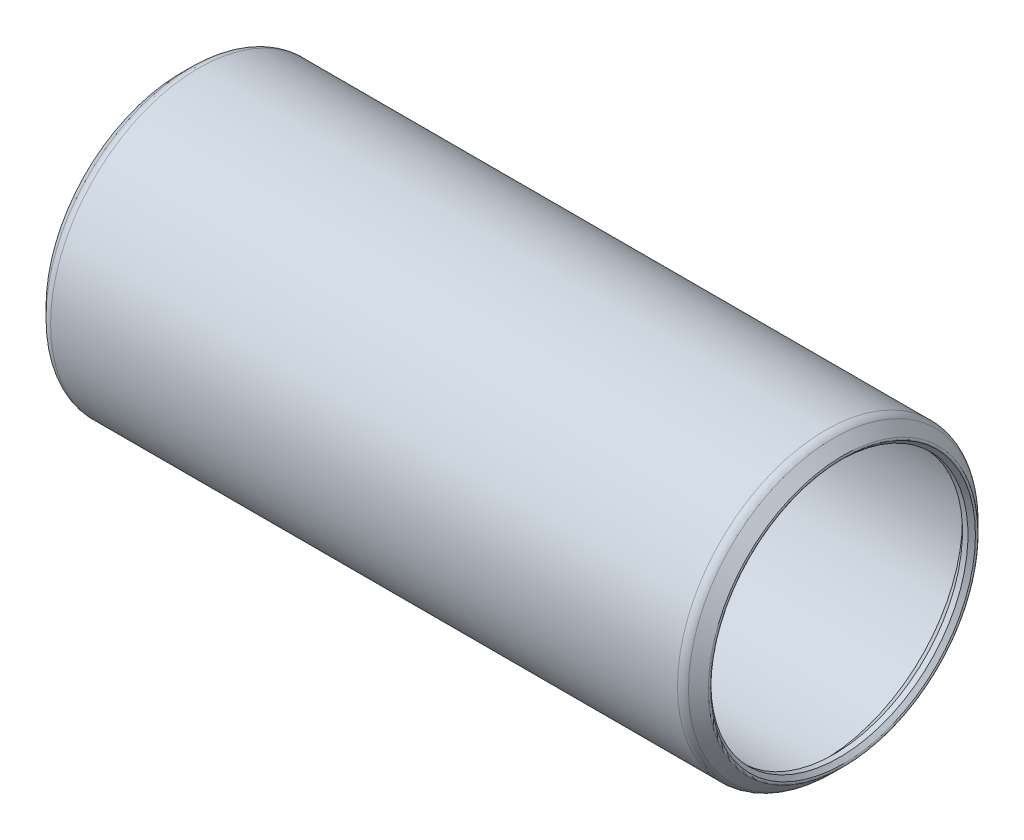
ISO-10303-21;
HEADER;
FILE_DESCRIPTION(('STEP AP214'),'2;1');
FILE_NAME('part.step','',(''),(''),'','','');
FILE_SCHEMA(('AUTOMOTIVE_DESIGN { 1 0 10303 214 1 1 1 1 }'));
ENDSEC;
DATA;
#1=APPLICATION_CONTEXT('core data for automotive mechanical design processes');
#2=APPLICATION_PROTOCOL_DEFINITION('international standard','automotive_design',2000,#1);
#3=PRODUCT_CONTEXT('',#1,'mechanical');
#4=PRODUCT('Part','Part','',(#3));
#5=PRODUCT_RELATED_PRODUCT_CATEGORY('part','',(#4));
#6=PRODUCT_DEFINITION_FORMATION('','',#4);
#7=PRODUCT_DEFINITION_CONTEXT('part definition',#1,'design');
#8=PRODUCT_DEFINITION('design','',#6,#7);
#9=PRODUCT_DEFINITION_SHAPE('','',#8);
#10=(LENGTH_UNIT() NAMED_UNIT(*) SI_UNIT(.MILLI.,.METRE.));
#11=(NAMED_UNIT(*) PLANE_ANGLE_UNIT() SI_UNIT($,.RADIAN.));
#12=(NAMED_UNIT(*) SI_UNIT($,.STERADIAN.) SOLID_ANGLE_UNIT());
#13=UNCERTAINTY_MEASURE_WITH_UNIT(LENGTH_MEASURE(1.E-05),#10,'distance_accuracy_value','');
#14=(GEOMETRIC_REPRESENTATION_CONTEXT(3) GLOBAL_UNCERTAINTY_ASSIGNED_CONTEXT((#13)) GLOBAL_UNIT_ASSIGNED_CONTEXT((#10,
#11,#12)) REPRESENTATION_CONTEXT('',''));
#15=CARTESIAN_POINT('',(0.,0.,0.));
#16=DIRECTION('',(0.,0.,1.));
#17=DIRECTION('',(1.,0.,0.));
#18=AXIS2_PLACEMENT_3D('',#15,#16,#17);
#19=CARTESIAN_POINT('',(-0.549710244842875,0.,0.));
#20=DIRECTION('',(-1.,0.,0.));
#21=DIRECTION('',(0.,0.,1.));
#22=AXIS2_PLACEMENT_3D('',#19,#20,#21);
#23=TOROIDAL_SURFACE('',#22,9.25736536726415,0.126999999999895);
#24=CARTESIAN_POINT('',(-0.639512806053462,0.,0.));
#25=DIRECTION('',(-1.,0.,0.));
#26=DIRECTION('',(0.,0.,1.));
#27=AXIS2_PLACEMENT_3D('',#24,#25,#26);
#28=CIRCLE('',#27,9.1675628060535);
#29=CARTESIAN_POINT('',(-0.639512806053462,0.,9.1675628060535));
#30=VERTEX_POINT('',#29);
#31=EDGE_CURVE('E10',#30,#30,#28,.T.);
#32=ORIENTED_EDGE('',*,*,#31,.F.);
#33=EDGE_LOOP('',(#32));
#34=FACE_BOUND('',#33,.T.);
#35=CARTESIAN_POINT('',(-0.639512806053462,0.,0.));
#36=DIRECTION('',(-1.,0.,0.));
#37=DIRECTION('',(0.,0.,1.));
#38=AXIS2_PLACEMENT_3D('',#35,#36,#37);
#39=CIRCLE('',#38,9.3471679284748);
#40=CARTESIAN_POINT('',(-0.639512806053462,0.,9.3471679284748));
#41=VERTEX_POINT('',#40);
#42=EDGE_CURVE('E81',#41,#41,#39,.T.);
#43=ORIENTED_EDGE('',*,*,#42,.T.);
#44=EDGE_LOOP('',(#43));
#45=FACE_BOUND('',#44,.T.);
#46=ADVANCED_FACE('F35',(#34,#45),#23,.T.);
#47=CARTESIAN_POINT('',(-0.639512806053462,0.,0.));
#48=DIRECTION('',(-1.,0.,0.));
#49=DIRECTION('',(0.,0.,1.));
#50=AXIS2_PLACEMENT_3D('',#47,#48,#49);
#51=CONICAL_SURFACE('',#50,9.1675628060535,0.785398163397522);
#52=CARTESIAN_POINT('',(-0.380999999999999,0.,0.));
#53=DIRECTION('',(-1.,0.,0.));
#54=DIRECTION('',(0.,0.,1.));
#55=AXIS2_PLACEMENT_3D('',#52,#53,#54);
#56=CIRCLE('',#55,8.90905);
#57=CARTESIAN_POINT('',(-0.380999999999999,0.,8.90905));
#58=VERTEX_POINT('',#57);
#59=EDGE_CURVE('E41',#58,#58,#56,.T.);
#60=ORIENTED_EDGE('',*,*,#59,.F.);
#61=EDGE_LOOP('',(#60));
#62=FACE_BOUND('',#61,.T.);
#63=ORIENTED_EDGE('',*,*,#31,.T.);
#64=EDGE_LOOP('',(#63));
#65=FACE_BOUND('',#64,.T.);
#66=ADVANCED_FACE('F154',(#62,#65),#51,.F.);
#67=CARTESIAN_POINT('',(44.6151,0.,0.));
#68=DIRECTION('',(-1.,0.,0.));
#69=DIRECTION('',(0.,0.,1.));
#70=AXIS2_PLACEMENT_3D('',#67,#68,#69);
#71=CYLINDRICAL_SURFACE('',#70,8.90905);
#72=CARTESIAN_POINT('',(0.,0.,0.));
#73=DIRECTION('',(-1.,0.,0.));
#74=DIRECTION('',(0.,0.,1.));
#75=AXIS2_PLACEMENT_3D('',#72,#73,#74);
#76=CIRCLE('',#75,8.90905);
#77=CARTESIAN_POINT('',(0.,0.,8.90905));
#78=VERTEX_POINT('',#77);
#79=EDGE_CURVE('E45',#78,#78,#76,.T.);
#80=ORIENTED_EDGE('',*,*,#79,.F.);
#81=EDGE_LOOP('',(#80));
#82=FACE_BOUND('',#81,.T.);
#83=ORIENTED_EDGE('',*,*,#59,.T.);
#84=EDGE_LOOP('',(#83));
#85=FACE_BOUND('',#84,.T.);
#86=ADVANCED_FACE('F149',(#82,#85),#71,.F.);
#87=CARTESIAN_POINT('',(0.,0.,0.));
#88=DIRECTION('',(1.,0.,0.));
#89=DIRECTION('',(0.,0.,-1.));
#90=AXIS2_PLACEMENT_3D('',#87,#88,#89);
#91=CONICAL_SURFACE('',#90,8.90905,0.785398163397448);
#92=CARTESIAN_POINT('',(0.761999999999999,0.,0.));
#93=DIRECTION('',(-1.,0.,0.));
#94=DIRECTION('',(0.,0.,1.));
#95=AXIS2_PLACEMENT_3D('',#92,#93,#94);
#96=CIRCLE('',#95,9.67105);
#97=CARTESIAN_POINT('',(0.761999999999999,0.,9.67105));
#98=VERTEX_POINT('',#97);
#99=EDGE_CURVE('E49',#98,#98,#96,.T.);
#100=ORIENTED_EDGE('',*,*,#99,.F.);
#101=EDGE_LOOP('',(#100));
#102=FACE_BOUND('',#101,.T.);
#103=ORIENTED_EDGE('',*,*,#79,.T.);
#104=EDGE_LOOP('',(#103));
#105=FACE_BOUND('',#104,.T.);
#106=ADVANCED_FACE('F143',(#102,#105),#91,.F.);
#107=CARTESIAN_POINT('',(44.6151,0.,0.));
#108=DIRECTION('',(-1.,0.,0.));
#109=DIRECTION('',(0.,0.,1.));
#110=AXIS2_PLACEMENT_3D('',#107,#108,#109);
#111=CYLINDRICAL_SURFACE('',#110,9.67105);
#112=CARTESIAN_POINT('',(43.8531,0.,0.));
#113=DIRECTION('',(-1.,0.,0.));
#114=DIRECTION('',(0.,0.,1.));
#115=AXIS2_PLACEMENT_3D('',#112,#113,#114);
#116=CIRCLE('',#115,9.67105);
#117=CARTESIAN_POINT('',(43.8531,0.,9.67105));
#118=VERTEX_POINT('',#117);
#119=EDGE_CURVE('E54',#118,#118,#116,.T.);
#120=ORIENTED_EDGE('',*,*,#119,.F.);
#121=EDGE_LOOP('',(#120));
#122=FACE_BOUND('',#121,.T.);
#123=ORIENTED_EDGE('',*,*,#99,.T.);
#124=EDGE_LOOP('',(#123));
#125=FACE_BOUND('',#124,.T.);
#126=ADVANCED_FACE('F137',(#122,#125),#111,.F.);
#127=CARTESIAN_POINT('',(43.8531,0.,0.));
#128=DIRECTION('',(-1.,0.,0.));
#129=DIRECTION('',(0.,0.,1.));
#130=AXIS2_PLACEMENT_3D('',#127,#128,#129);
#131=CONICAL_SURFACE('',#130,9.67105,0.785398163397448);
#132=CARTESIAN_POINT('',(44.6151,0.,0.));
#133=DIRECTION('',(-1.,0.,0.));
#134=DIRECTION('',(0.,0.,1.));
#135=AXIS2_PLACEMENT_3D('',#132,#133,#134);
#136=CIRCLE('',#135,8.90905);
#137=CARTESIAN_POINT('',(44.6151,0.,8.90905));
#138=VERTEX_POINT('',#137);
#139=EDGE_CURVE('E57',#138,#138,#136,.T.);
#140=ORIENTED_EDGE('',*,*,#139,.F.);
#141=EDGE_LOOP('',(#140));
#142=FACE_BOUND('',#141,.T.);
#143=ORIENTED_EDGE('',*,*,#119,.T.);
#144=EDGE_LOOP('',(#143));
#145=FACE_BOUND('',#144,.T.);
#146=ADVANCED_FACE('F131',(#142,#145),#131,.F.);
#147=CARTESIAN_POINT('',(44.6151,0.,0.));
#148=DIRECTION('',(-1.,0.,0.));
#149=DIRECTION('',(0.,0.,1.));
#150=AXIS2_PLACEMENT_3D('',#147,#148,#149);
#151=CYLINDRICAL_SURFACE('',#150,8.90905);
#152=CARTESIAN_POINT('',(44.9961,0.,0.));
#153=DIRECTION('',(-1.,0.,0.));
#154=DIRECTION('',(0.,0.,1.));
#155=AXIS2_PLACEMENT_3D('',#152,#153,#154);
#156=CIRCLE('',#155,8.90905);
#157=CARTESIAN_POINT('',(44.9961,0.,8.90905));
#158=VERTEX_POINT('',#157);
#159=EDGE_CURVE('E60',#158,#158,#156,.T.);
#160=ORIENTED_EDGE('',*,*,#159,.F.);
#161=EDGE_LOOP('',(#160));
#162=FACE_BOUND('',#161,.T.);
#163=ORIENTED_EDGE('',*,*,#139,.T.);
#164=EDGE_LOOP('',(#163));
#165=FACE_BOUND('',#164,.T.);
#166=ADVANCED_FACE('F125',(#162,#165),#151,.F.);
#167=CARTESIAN_POINT('',(44.9961,0.,0.));
#168=DIRECTION('',(1.,0.,0.));
#169=DIRECTION('',(0.,0.,-1.));
#170=AXIS2_PLACEMENT_3D('',#167,#168,#169);
#171=CONICAL_SURFACE('',#170,8.90905,0.785398163397676);
#172=CARTESIAN_POINT('',(45.2546128060545,0.,0.));
#173=DIRECTION('',(-1.,0.,0.));
#174=DIRECTION('',(0.,0.,1.));
#175=AXIS2_PLACEMENT_3D('',#172,#173,#174);
#176=CIRCLE('',#175,9.16756280605467);
#177=CARTESIAN_POINT('',(45.2546128060545,0.,9.16756280605467));
#178=VERTEX_POINT('',#177);
#179=EDGE_CURVE('E63',#178,#178,#176,.T.);
#180=ORIENTED_EDGE('',*,*,#179,.F.);
#181=EDGE_LOOP('',(#180));
#182=FACE_BOUND('',#181,.T.);
#183=ORIENTED_EDGE('',*,*,#159,.T.);
#184=EDGE_LOOP('',(#183));
#185=FACE_BOUND('',#184,.T.);
#186=ADVANCED_FACE('F119',(#182,#185),#171,.F.);
#187=CARTESIAN_POINT('',(45.1648102448448,0.,0.));
#188=DIRECTION('',(-1.,0.,0.));
#189=DIRECTION('',(0.,0.,1.));
#190=AXIS2_PLACEMENT_3D('',#187,#188,#189);
#191=TOROIDAL_SURFACE('',#190,9.25736536726415,0.126999999998485);
#192=CARTESIAN_POINT('',(45.2546128060546,0.,0.));
#193=DIRECTION('',(-1.,0.,0.));
#194=DIRECTION('',(0.,0.,1.));
#195=AXIS2_PLACEMENT_3D('',#192,#193,#194);
#196=CIRCLE('',#195,9.34716792847346);
#197=CARTESIAN_POINT('',(45.2546128060546,0.,9.34716792847346));
#198=VERTEX_POINT('',#197);
#199=EDGE_CURVE('E66',#198,#198,#196,.T.);
#200=ORIENTED_EDGE('',*,*,#199,.F.);
#201=EDGE_LOOP('',(#200));
#202=FACE_BOUND('',#201,.T.);
#203=ORIENTED_EDGE('',*,*,#179,.T.);
#204=EDGE_LOOP('',(#203));
#205=FACE_BOUND('',#204,.T.);
#206=ADVANCED_FACE('F113',(#202,#205),#191,.T.);
#207=CARTESIAN_POINT('',(45.2546128060546,0.,0.));
#208=DIRECTION('',(-1.,0.,0.));
#209=DIRECTION('',(0.,0.,1.));
#210=AXIS2_PLACEMENT_3D('',#207,#208,#209);
#211=CONICAL_SURFACE('',#210,9.34716792847346,0.785398163397458);
#212=CARTESIAN_POINT('',(44.5697153672624,0.,0.));
#213=DIRECTION('',(-1.,0.,0.));
#214=DIRECTION('',(0.,0.,1.));
#215=AXIS2_PLACEMENT_3D('',#212,#213,#214);
#216=CIRCLE('',#215,10.0320653672657);
#217=CARTESIAN_POINT('',(44.5697153672624,0.,10.0320653672657));
#218=VERTEX_POINT('',#217);
#219=EDGE_CURVE('E69',#218,#218,#216,.T.);
#220=ORIENTED_EDGE('',*,*,#219,.F.);
#221=EDGE_LOOP('',(#220));
#222=FACE_BOUND('',#221,.T.);
#223=ORIENTED_EDGE('',*,*,#199,.T.);
#224=EDGE_LOOP('',(#223));
#225=FACE_BOUND('',#224,.T.);
#226=ADVANCED_FACE('F107',(#222,#225),#211,.T.);
#227=CARTESIAN_POINT('',(44.0309000000017,0.,0.));
#228=DIRECTION('',(-1.,0.,0.));
#229=DIRECTION('',(0.,0.,1.));
#230=AXIS2_PLACEMENT_3D('',#227,#228,#229);
#231=TOROIDAL_SURFACE('',#230,9.49325000000489,0.761999999995164);
#232=CARTESIAN_POINT('',(44.0309000000017,0.,0.));
#233=DIRECTION('',(-1.,0.,0.));
#234=DIRECTION('',(0.,0.,1.));
#235=AXIS2_PLACEMENT_3D('',#232,#233,#234);
#236=CIRCLE('',#235,10.2552500000001);
#237=CARTESIAN_POINT('',(44.0309000000017,0.,10.2552500000001));
#238=VERTEX_POINT('',#237);
#239=EDGE_CURVE('E72',#238,#238,#236,.T.);
#240=ORIENTED_EDGE('',*,*,#239,.F.);
#241=EDGE_LOOP('',(#240));
#242=FACE_BOUND('',#241,.T.);
#243=ORIENTED_EDGE('',*,*,#219,.T.);
#244=EDGE_LOOP('',(#243));
#245=FACE_BOUND('',#244,.T.);
#246=ADVANCED_FACE('F101',(#242,#245),#231,.T.);
#247=CARTESIAN_POINT('',(44.6151,0.,0.));
#248=DIRECTION('',(-1.,0.,0.));
#249=DIRECTION('',(0.,0.,1.));
#250=AXIS2_PLACEMENT_3D('',#247,#248,#249);
#251=CYLINDRICAL_SURFACE('',#250,10.2552500000001);
#252=CARTESIAN_POINT('',(0.584199999997953,0.,0.));
#253=DIRECTION('',(-1.,0.,0.));
#254=DIRECTION('',(0.,0.,1.));
#255=AXIS2_PLACEMENT_3D('',#252,#253,#254);
#256=CIRCLE('',#255,10.2552500000001);
#257=CARTESIAN_POINT('',(0.584199999997953,0.,10.2552500000001));
#258=VERTEX_POINT('',#257);
#259=EDGE_CURVE('E75',#258,#258,#256,.T.);
#260=ORIENTED_EDGE('',*,*,#259,.F.);
#261=EDGE_LOOP('',(#260));
#262=FACE_BOUND('',#261,.T.);
#263=ORIENTED_EDGE('',*,*,#239,.T.);
#264=EDGE_LOOP('',(#263));
#265=FACE_BOUND('',#264,.T.);
#266=ADVANCED_FACE('F95',(#262,#265),#251,.T.);
#267=CARTESIAN_POINT('',(0.584199999998007,0.,0.));
#268=DIRECTION('',(-1.,0.,0.));
#269=DIRECTION('',(0.,0.,1.));
#270=AXIS2_PLACEMENT_3D('',#267,#268,#269);
#271=TOROIDAL_SURFACE('',#270,9.49325000000518,0.761999999994892);
#272=CARTESIAN_POINT('',(0.0453846327374621,0.,0.));
#273=DIRECTION('',(-1.,0.,0.));
#274=DIRECTION('',(0.,0.,1.));
#275=AXIS2_PLACEMENT_3D('',#272,#273,#274);
#276=CIRCLE('',#275,10.0320653672657);
#277=CARTESIAN_POINT('',(0.0453846327374621,0.,10.0320653672657));
#278=VERTEX_POINT('',#277);
#279=EDGE_CURVE('E78',#278,#278,#276,.T.);
#280=ORIENTED_EDGE('',*,*,#279,.F.);
#281=EDGE_LOOP('',(#280));
#282=FACE_BOUND('',#281,.T.);
#283=ORIENTED_EDGE('',*,*,#259,.T.);
#284=EDGE_LOOP('',(#283));
#285=FACE_BOUND('',#284,.T.);
#286=ADVANCED_FACE('F89',(#282,#285),#271,.T.);
#287=CARTESIAN_POINT('',(0.0453846327374621,0.,0.));
#288=DIRECTION('',(1.,0.,0.));
#289=DIRECTION('',(0.,0.,-1.));
#290=AXIS2_PLACEMENT_3D('',#287,#288,#289);
#291=CONICAL_SURFACE('',#290,10.0320653672657,0.785398163397446);
#292=ORIENTED_EDGE('',*,*,#42,.F.);
#293=EDGE_LOOP('',(#292));
#294=FACE_BOUND('',#293,.T.);
#295=ORIENTED_EDGE('',*,*,#279,.T.);
#296=EDGE_LOOP('',(#295));
#297=FACE_BOUND('',#296,.T.);
#298=ADVANCED_FACE('F86',(#294,#297),#291,.T.);
#299=CLOSED_SHELL('',(#46,#66,#86,#106,#126,#146,#166,#186,#206,#226,#246,#266,#286,#298));
#300=MANIFOLD_SOLID_BREP('B2',#299);
#301=ADVANCED_BREP_SHAPE_REPRESENTATION('',(#18,#300),#14);
#302=SHAPE_DEFINITION_REPRESENTATION(#9,#301);
ENDSEC;
END-ISO-10303-21;
